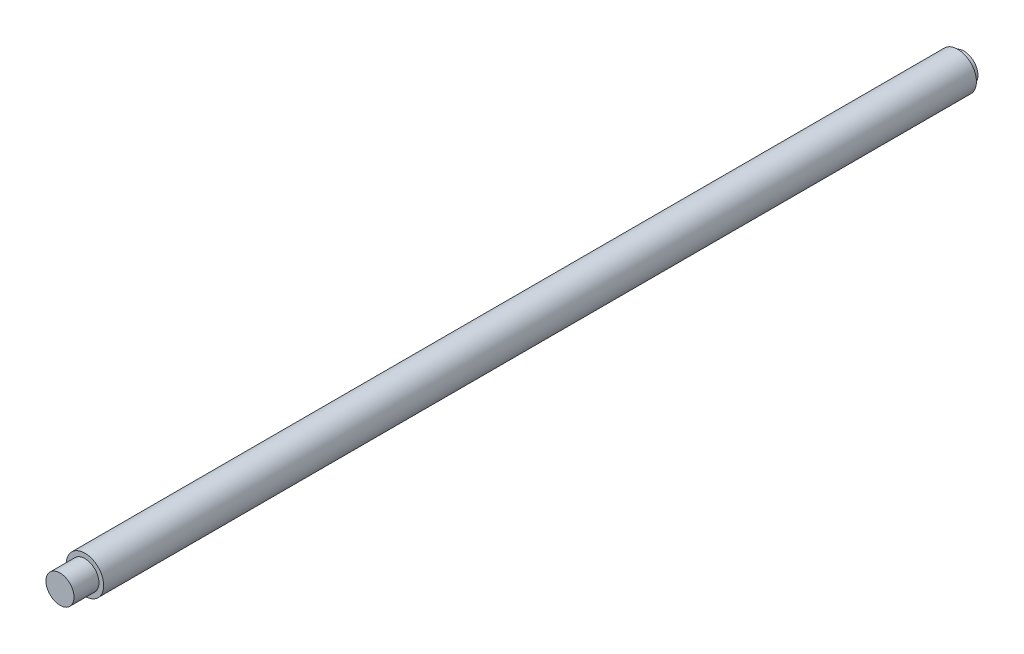
ISO-10303-21;
HEADER;
FILE_DESCRIPTION(('STEP AP214'),'2;1');
FILE_NAME('part.step','',(''),(''),'','','');
FILE_SCHEMA(('AUTOMOTIVE_DESIGN { 1 0 10303 214 1 1 1 1 }'));
ENDSEC;
DATA;
#1=APPLICATION_CONTEXT('core data for automotive mechanical design processes');
#2=APPLICATION_PROTOCOL_DEFINITION('international standard','automotive_design',2000,#1);
#3=PRODUCT_CONTEXT('',#1,'mechanical');
#4=PRODUCT('Part','Part','',(#3));
#5=PRODUCT_RELATED_PRODUCT_CATEGORY('part','',(#4));
#6=PRODUCT_DEFINITION_FORMATION('','',#4);
#7=PRODUCT_DEFINITION_CONTEXT('part definition',#1,'design');
#8=PRODUCT_DEFINITION('design','',#6,#7);
#9=PRODUCT_DEFINITION_SHAPE('','',#8);
#10=(LENGTH_UNIT() NAMED_UNIT(*) SI_UNIT(.MILLI.,.METRE.));
#11=(NAMED_UNIT(*) PLANE_ANGLE_UNIT() SI_UNIT($,.RADIAN.));
#12=(NAMED_UNIT(*) SI_UNIT($,.STERADIAN.) SOLID_ANGLE_UNIT());
#13=UNCERTAINTY_MEASURE_WITH_UNIT(LENGTH_MEASURE(1.E-05),#10,'distance_accuracy_value','');
#14=(GEOMETRIC_REPRESENTATION_CONTEXT(3) GLOBAL_UNCERTAINTY_ASSIGNED_CONTEXT((#13)) GLOBAL_UNIT_ASSIGNED_CONTEXT((#10,
#11,#12)) REPRESENTATION_CONTEXT('',''));
#15=CARTESIAN_POINT('',(0.,0.,0.));
#16=DIRECTION('',(0.,0.,1.));
#17=DIRECTION('',(1.,0.,0.));
#18=AXIS2_PLACEMENT_3D('',#15,#16,#17);
#19=CARTESIAN_POINT('',(0.,0.,282.));
#20=DIRECTION('',(0.,0.,1.));
#21=DIRECTION('',(1.,0.,0.));
#22=AXIS2_PLACEMENT_3D('',#19,#20,#21);
#23=PLANE('',#22);
#24=CARTESIAN_POINT('',(0.,0.,282.));
#25=DIRECTION('',(0.,0.,1.));
#26=DIRECTION('',(1.,0.,0.));
#27=AXIS2_PLACEMENT_3D('',#24,#25,#26);
#28=CIRCLE('',#27,6.);
#29=CARTESIAN_POINT('',(6.,0.,282.));
#30=VERTEX_POINT('',#29);
#31=EDGE_CURVE('E48',#30,#30,#28,.T.);
#32=ORIENTED_EDGE('',*,*,#31,.T.);
#33=EDGE_LOOP('',(#32));
#34=FACE_BOUND('',#33,.T.);
#35=CARTESIAN_POINT('',(0.,0.,282.));
#36=DIRECTION('',(0.,0.,1.));
#37=DIRECTION('',(1.,0.,0.));
#38=AXIS2_PLACEMENT_3D('',#35,#36,#37);
#39=CIRCLE('',#38,4.5);
#40=CARTESIAN_POINT('',(4.5,0.,282.));
#41=VERTEX_POINT('',#40);
#42=EDGE_CURVE('E56',#41,#41,#39,.T.);
#43=ORIENTED_EDGE('',*,*,#42,.F.);
#44=EDGE_LOOP('',(#43));
#45=FACE_BOUND('',#44,.T.);
#46=ADVANCED_FACE('F37',(#34,#45),#23,.T.);
#47=CARTESIAN_POINT('',(0.,0.,2.));
#48=DIRECTION('',(0.,0.,-1.));
#49=DIRECTION('',(-1.,0.,0.));
#50=AXIS2_PLACEMENT_3D('',#47,#48,#49);
#51=CYLINDRICAL_SURFACE('',#50,4.5);
#52=CARTESIAN_POINT('',(0.,0.,2.));
#53=DIRECTION('',(0.,0.,1.));
#54=DIRECTION('',(1.,0.,0.));
#55=AXIS2_PLACEMENT_3D('',#52,#53,#54);
#56=CIRCLE('',#55,4.5);
#57=CARTESIAN_POINT('',(4.5,0.,2.));
#58=VERTEX_POINT('',#57);
#59=EDGE_CURVE('E10',#58,#58,#56,.T.);
#60=ORIENTED_EDGE('',*,*,#59,.F.);
#61=EDGE_LOOP('',(#60));
#62=FACE_BOUND('',#61,.T.);
#63=CARTESIAN_POINT('',(0.,0.,0.));
#64=DIRECTION('',(0.,0.,1.));
#65=DIRECTION('',(1.,0.,0.));
#66=AXIS2_PLACEMENT_3D('',#63,#64,#65);
#67=CIRCLE('',#66,4.5);
#68=CARTESIAN_POINT('',(4.5,0.,0.));
#69=VERTEX_POINT('',#68);
#70=EDGE_CURVE('E41',#69,#69,#67,.T.);
#71=ORIENTED_EDGE('',*,*,#70,.T.);
#72=EDGE_LOOP('',(#71));
#73=FACE_BOUND('',#72,.T.);
#74=ADVANCED_FACE('F39',(#62,#73),#51,.T.);
#75=CARTESIAN_POINT('',(0.,0.,0.));
#76=DIRECTION('',(0.,0.,1.));
#77=DIRECTION('',(1.,0.,0.));
#78=AXIS2_PLACEMENT_3D('',#75,#76,#77);
#79=PLANE('',#78);
#80=ORIENTED_EDGE('',*,*,#70,.F.);
#81=EDGE_LOOP('',(#80));
#82=FACE_BOUND('',#81,.T.);
#83=ADVANCED_FACE('F77',(#82),#79,.F.);
#84=CARTESIAN_POINT('',(0.,0.,2.));
#85=DIRECTION('',(0.,0.,1.));
#86=DIRECTION('',(1.,0.,0.));
#87=AXIS2_PLACEMENT_3D('',#84,#85,#86);
#88=PLANE('',#87);
#89=CARTESIAN_POINT('',(0.,0.,2.));
#90=DIRECTION('',(0.,0.,1.));
#91=DIRECTION('',(1.,0.,0.));
#92=AXIS2_PLACEMENT_3D('',#89,#90,#91);
#93=CIRCLE('',#92,6.);
#94=CARTESIAN_POINT('',(6.,0.,2.));
#95=VERTEX_POINT('',#94);
#96=EDGE_CURVE('E50',#95,#95,#93,.T.);
#97=ORIENTED_EDGE('',*,*,#96,.F.);
#98=EDGE_LOOP('',(#97));
#99=FACE_BOUND('',#98,.T.);
#100=ORIENTED_EDGE('',*,*,#59,.T.);
#101=EDGE_LOOP('',(#100));
#102=FACE_BOUND('',#101,.T.);
#103=ADVANCED_FACE('F81',(#99,#102),#88,.F.);
#104=CARTESIAN_POINT('',(0.,0.,282.));
#105=DIRECTION('',(0.,0.,-1.));
#106=DIRECTION('',(-1.,0.,0.));
#107=AXIS2_PLACEMENT_3D('',#104,#105,#106);
#108=CYLINDRICAL_SURFACE('',#107,6.);
#109=ORIENTED_EDGE('',*,*,#31,.F.);
#110=EDGE_LOOP('',(#109));
#111=FACE_BOUND('',#110,.T.);
#112=ORIENTED_EDGE('',*,*,#96,.T.);
#113=EDGE_LOOP('',(#112));
#114=FACE_BOUND('',#113,.T.);
#115=ADVANCED_FACE('F67',(#111,#114),#108,.T.);
#116=CARTESIAN_POINT('',(0.,0.,290.));
#117=DIRECTION('',(0.,0.,-1.));
#118=DIRECTION('',(-1.,0.,0.));
#119=AXIS2_PLACEMENT_3D('',#116,#117,#118);
#120=CYLINDRICAL_SURFACE('',#119,4.5);
#121=CARTESIAN_POINT('',(0.,0.,290.));
#122=DIRECTION('',(0.,0.,1.));
#123=DIRECTION('',(1.,0.,0.));
#124=AXIS2_PLACEMENT_3D('',#121,#122,#123);
#125=CIRCLE('',#124,4.5);
#126=CARTESIAN_POINT('',(4.5,0.,290.));
#127=VERTEX_POINT('',#126);
#128=EDGE_CURVE('E53',#127,#127,#125,.T.);
#129=ORIENTED_EDGE('',*,*,#128,.F.);
#130=EDGE_LOOP('',(#129));
#131=FACE_BOUND('',#130,.T.);
#132=ORIENTED_EDGE('',*,*,#42,.T.);
#133=EDGE_LOOP('',(#132));
#134=FACE_BOUND('',#133,.T.);
#135=ADVANCED_FACE('F64',(#131,#134),#120,.T.);
#136=CARTESIAN_POINT('',(0.,0.,290.));
#137=DIRECTION('',(0.,0.,1.));
#138=DIRECTION('',(1.,0.,0.));
#139=AXIS2_PLACEMENT_3D('',#136,#137,#138);
#140=PLANE('',#139);
#141=ORIENTED_EDGE('',*,*,#128,.T.);
#142=EDGE_LOOP('',(#141));
#143=FACE_BOUND('',#142,.T.);
#144=ADVANCED_FACE('F62',(#143),#140,.T.);
#145=CLOSED_SHELL('',(#46,#74,#83,#103,#115,#135,#144));
#146=MANIFOLD_SOLID_BREP('B2',#145);
#147=ADVANCED_BREP_SHAPE_REPRESENTATION('',(#18,#146),#14);
#148=SHAPE_DEFINITION_REPRESENTATION(#9,#147);
ENDSEC;
END-ISO-10303-21;
